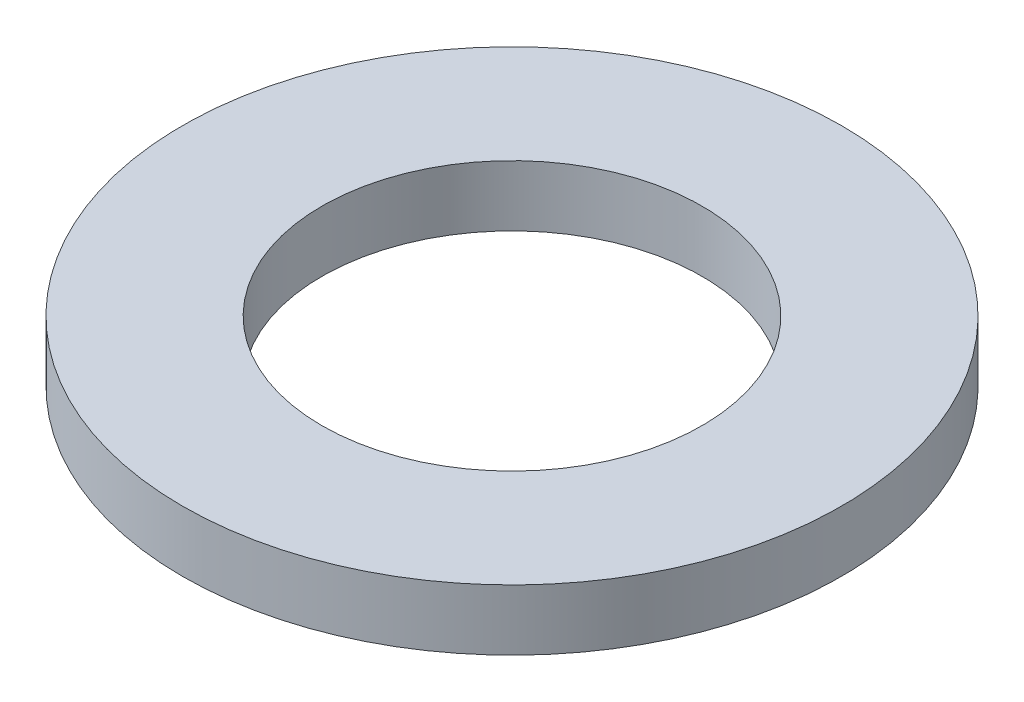
ISO-10303-21;
HEADER;
FILE_DESCRIPTION(('STEP AP214'),'2;1');
FILE_NAME('part.step','',(''),(''),'','','');
FILE_SCHEMA(('AUTOMOTIVE_DESIGN { 1 0 10303 214 1 1 1 1 }'));
ENDSEC;
DATA;
#1=APPLICATION_CONTEXT('core data for automotive mechanical design processes');
#2=APPLICATION_PROTOCOL_DEFINITION('international standard','automotive_design',2000,#1);
#3=PRODUCT_CONTEXT('',#1,'mechanical');
#4=PRODUCT('Part','Part','',(#3));
#5=PRODUCT_RELATED_PRODUCT_CATEGORY('part','',(#4));
#6=PRODUCT_DEFINITION_FORMATION('','',#4);
#7=PRODUCT_DEFINITION_CONTEXT('part definition',#1,'design');
#8=PRODUCT_DEFINITION('design','',#6,#7);
#9=PRODUCT_DEFINITION_SHAPE('','',#8);
#10=(LENGTH_UNIT() NAMED_UNIT(*) SI_UNIT(.MILLI.,.METRE.));
#11=(NAMED_UNIT(*) PLANE_ANGLE_UNIT() SI_UNIT($,.RADIAN.));
#12=(NAMED_UNIT(*) SI_UNIT($,.STERADIAN.) SOLID_ANGLE_UNIT());
#13=UNCERTAINTY_MEASURE_WITH_UNIT(LENGTH_MEASURE(1.E-05),#10,'distance_accuracy_value','');
#14=(GEOMETRIC_REPRESENTATION_CONTEXT(3) GLOBAL_UNCERTAINTY_ASSIGNED_CONTEXT((#13)) GLOBAL_UNIT_ASSIGNED_CONTEXT((#10,
#11,#12)) REPRESENTATION_CONTEXT('',''));
#15=CARTESIAN_POINT('',(0.,0.,0.));
#16=DIRECTION('',(0.,0.,1.));
#17=DIRECTION('',(1.,0.,0.));
#18=AXIS2_PLACEMENT_3D('',#15,#16,#17);
#19=CARTESIAN_POINT('',(0.,12.,0.));
#20=DIRECTION('',(0.,-1.,0.));
#21=DIRECTION('',(0.,0.,-1.));
#22=AXIS2_PLACEMENT_3D('',#19,#20,#21);
#23=CYLINDRICAL_SURFACE('',#22,65.);
#24=CARTESIAN_POINT('',(0.,12.,0.));
#25=DIRECTION('',(0.,1.,0.));
#26=DIRECTION('',(0.,0.,1.));
#27=AXIS2_PLACEMENT_3D('',#24,#25,#26);
#28=CIRCLE('',#27,65.);
#29=CARTESIAN_POINT('',(0.,12.,65.));
#30=VERTEX_POINT('',#29);
#31=EDGE_CURVE('E10',#30,#30,#28,.T.);
#32=ORIENTED_EDGE('',*,*,#31,.F.);
#33=EDGE_LOOP('',(#32));
#34=FACE_BOUND('',#33,.T.);
#35=CARTESIAN_POINT('',(0.,0.,0.));
#36=DIRECTION('',(0.,1.,0.));
#37=DIRECTION('',(0.,0.,1.));
#38=AXIS2_PLACEMENT_3D('',#35,#36,#37);
#39=CIRCLE('',#38,65.);
#40=CARTESIAN_POINT('',(0.,0.,65.));
#41=VERTEX_POINT('',#40);
#42=EDGE_CURVE('E37',#41,#41,#39,.T.);
#43=ORIENTED_EDGE('',*,*,#42,.T.);
#44=EDGE_LOOP('',(#43));
#45=FACE_BOUND('',#44,.T.);
#46=ADVANCED_FACE('F40',(#34,#45),#23,.T.);
#47=CARTESIAN_POINT('',(0.,12.,0.));
#48=DIRECTION('',(0.,1.,0.));
#49=DIRECTION('',(0.,0.,1.));
#50=AXIS2_PLACEMENT_3D('',#47,#48,#49);
#51=PLANE('',#50);
#52=CARTESIAN_POINT('',(0.,12.,0.));
#53=DIRECTION('',(0.,1.,0.));
#54=DIRECTION('',(0.,0.,1.));
#55=AXIS2_PLACEMENT_3D('',#52,#53,#54);
#56=CIRCLE('',#55,37.5);
#57=CARTESIAN_POINT('',(0.,12.,37.5));
#58=VERTEX_POINT('',#57);
#59=EDGE_CURVE('E50',#58,#58,#56,.T.);
#60=ORIENTED_EDGE('',*,*,#59,.F.);
#61=EDGE_LOOP('',(#60));
#62=FACE_BOUND('',#61,.T.);
#63=ORIENTED_EDGE('',*,*,#31,.T.);
#64=EDGE_LOOP('',(#63));
#65=FACE_BOUND('',#64,.T.);
#66=ADVANCED_FACE('F59',(#62,#65),#51,.T.);
#67=CARTESIAN_POINT('',(0.,0.,0.));
#68=DIRECTION('',(0.,1.,0.));
#69=DIRECTION('',(0.,0.,1.));
#70=AXIS2_PLACEMENT_3D('',#67,#68,#69);
#71=PLANE('',#70);
#72=CARTESIAN_POINT('',(0.,0.,0.));
#73=DIRECTION('',(0.,1.,0.));
#74=DIRECTION('',(0.,0.,1.));
#75=AXIS2_PLACEMENT_3D('',#72,#73,#74);
#76=CIRCLE('',#75,37.5);
#77=CARTESIAN_POINT('',(0.,0.,37.5));
#78=VERTEX_POINT('',#77);
#79=EDGE_CURVE('E47',#78,#78,#76,.T.);
#80=ORIENTED_EDGE('',*,*,#79,.T.);
#81=EDGE_LOOP('',(#80));
#82=FACE_BOUND('',#81,.T.);
#83=ORIENTED_EDGE('',*,*,#42,.F.);
#84=EDGE_LOOP('',(#83));
#85=FACE_BOUND('',#84,.T.);
#86=ADVANCED_FACE('F58',(#82,#85),#71,.F.);
#87=CARTESIAN_POINT('',(0.,12.,0.));
#88=DIRECTION('',(0.,-1.,0.));
#89=DIRECTION('',(0.,0.,-1.));
#90=AXIS2_PLACEMENT_3D('',#87,#88,#89);
#91=CYLINDRICAL_SURFACE('',#90,37.5);
#92=ORIENTED_EDGE('',*,*,#59,.T.);
#93=EDGE_LOOP('',(#92));
#94=FACE_BOUND('',#93,.T.);
#95=ORIENTED_EDGE('',*,*,#79,.F.);
#96=EDGE_LOOP('',(#95));
#97=FACE_BOUND('',#96,.T.);
#98=ADVANCED_FACE('F54',(#94,#97),#91,.F.);
#99=CLOSED_SHELL('',(#46,#66,#86,#98));
#100=MANIFOLD_SOLID_BREP('B2',#99);
#101=ADVANCED_BREP_SHAPE_REPRESENTATION('',(#18,#100),#14);
#102=SHAPE_DEFINITION_REPRESENTATION(#9,#101);
ENDSEC;
END-ISO-10303-21;
